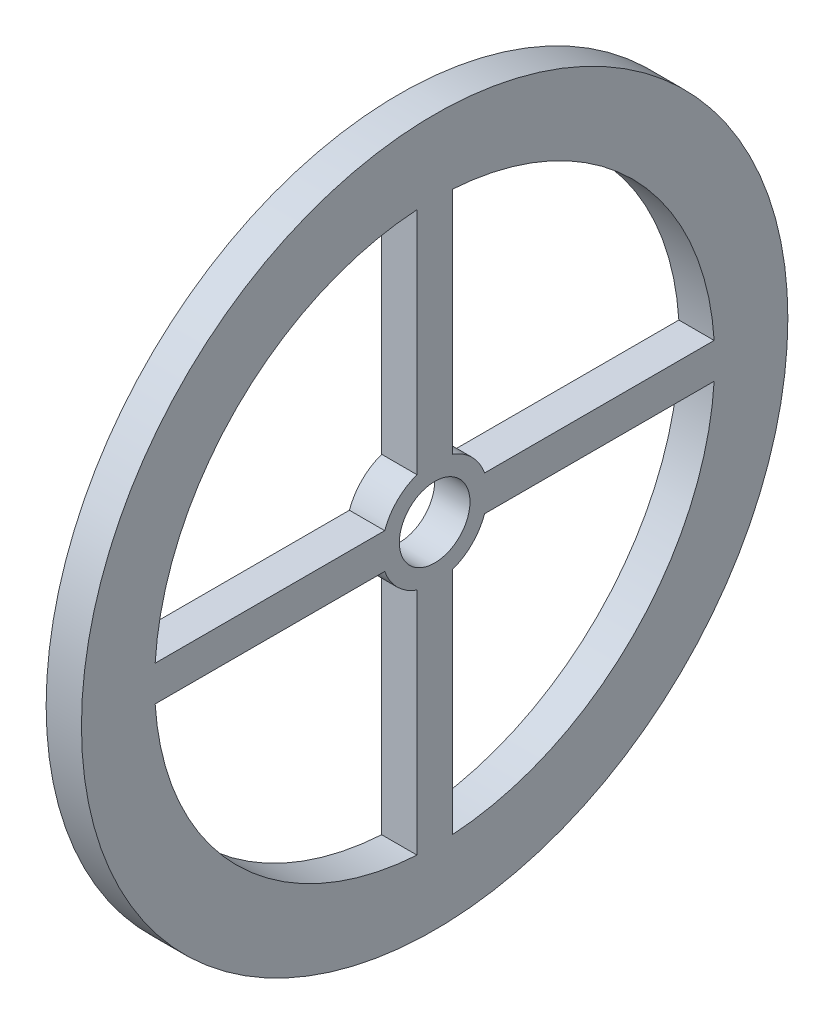
ISO-10303-21;
HEADER;
FILE_DESCRIPTION(('STEP AP214'),'2;1');
FILE_NAME('part.step','',(''),(''),'','','');
FILE_SCHEMA(('AUTOMOTIVE_DESIGN { 1 0 10303 214 1 1 1 1 }'));
ENDSEC;
DATA;
#1=APPLICATION_CONTEXT('core data for automotive mechanical design processes');
#2=APPLICATION_PROTOCOL_DEFINITION('international standard','automotive_design',2000,#1);
#3=PRODUCT_CONTEXT('',#1,'mechanical');
#4=PRODUCT('Part','Part','',(#3));
#5=PRODUCT_RELATED_PRODUCT_CATEGORY('part','',(#4));
#6=PRODUCT_DEFINITION_FORMATION('','',#4);
#7=PRODUCT_DEFINITION_CONTEXT('part definition',#1,'design');
#8=PRODUCT_DEFINITION('design','',#6,#7);
#9=PRODUCT_DEFINITION_SHAPE('','',#8);
#10=(LENGTH_UNIT() NAMED_UNIT(*) SI_UNIT(.MILLI.,.METRE.));
#11=(NAMED_UNIT(*) PLANE_ANGLE_UNIT() SI_UNIT($,.RADIAN.));
#12=(NAMED_UNIT(*) SI_UNIT($,.STERADIAN.) SOLID_ANGLE_UNIT());
#13=UNCERTAINTY_MEASURE_WITH_UNIT(LENGTH_MEASURE(1.E-05),#10,'distance_accuracy_value','');
#14=(GEOMETRIC_REPRESENTATION_CONTEXT(3) GLOBAL_UNCERTAINTY_ASSIGNED_CONTEXT((#13)) GLOBAL_UNIT_ASSIGNED_CONTEXT((#10,
#11,#12)) REPRESENTATION_CONTEXT('',''));
#15=CARTESIAN_POINT('',(0.,0.,0.));
#16=DIRECTION('',(0.,0.,1.));
#17=DIRECTION('',(1.,0.,0.));
#18=AXIS2_PLACEMENT_3D('',#15,#16,#17);
#19=CARTESIAN_POINT('',(10.,0.,0.));
#20=DIRECTION('',(-1.,0.,0.));
#21=DIRECTION('',(0.,0.,1.));
#22=AXIS2_PLACEMENT_3D('',#19,#20,#21);
#23=CYLINDRICAL_SURFACE('',#22,79.286499617892);
#24=CARTESIAN_POINT('',(0.,0.,0.));
#25=DIRECTION('',(1.,0.,0.));
#26=DIRECTION('',(0.,0.,-1.));
#27=AXIS2_PLACEMENT_3D('',#24,#25,#26);
#28=CIRCLE('',#27,79.286499617892);
#29=CARTESIAN_POINT('',(0.,5.,-79.1286864648845));
#30=VERTEX_POINT('',#29);
#31=CARTESIAN_POINT('',(0.,79.1286864648845,-4.99999999999999));
#32=VERTEX_POINT('',#31);
#33=EDGE_CURVE('E212',#30,#32,#28,.T.);
#34=ORIENTED_EDGE('',*,*,#33,.F.);
#35=DIRECTION('',(-1.,0.,0.));
#36=VECTOR('',#35,1.);
#37=CARTESIAN_POINT('',(10.,5.,-79.1286864648845));
#38=LINE('',#37,#36);
#39=CARTESIAN_POINT('',(10.,5.,-79.1286864648845));
#40=VERTEX_POINT('',#39);
#41=EDGE_CURVE('E11',#40,#30,#38,.T.);
#42=ORIENTED_EDGE('',*,*,#41,.F.);
#43=CARTESIAN_POINT('',(10.,0.,0.));
#44=DIRECTION('',(1.,0.,0.));
#45=DIRECTION('',(0.,0.,-1.));
#46=AXIS2_PLACEMENT_3D('',#43,#44,#45);
#47=CIRCLE('',#46,79.286499617892);
#48=CARTESIAN_POINT('',(10.,79.1286864648845,-4.99999999999999));
#49=VERTEX_POINT('',#48);
#50=EDGE_CURVE('E181',#40,#49,#47,.T.);
#51=ORIENTED_EDGE('',*,*,#50,.T.);
#52=DIRECTION('',(-1.,0.,0.));
#53=VECTOR('',#52,1.);
#54=CARTESIAN_POINT('',(10.,79.1286864648845,-4.99999999999999));
#55=LINE('',#54,#53);
#56=EDGE_CURVE('E59',#49,#32,#55,.T.);
#57=ORIENTED_EDGE('',*,*,#56,.T.);
#58=EDGE_LOOP('',(#34,#42,#51,#57));
#59=FACE_BOUND('',#58,.T.);
#60=ADVANCED_FACE('F40',(#59),#23,.F.);
#61=CARTESIAN_POINT('',(10.,5.,0.));
#62=DIRECTION('',(0.,1.,0.));
#63=DIRECTION('',(0.,0.,1.));
#64=AXIS2_PLACEMENT_3D('',#61,#62,#63);
#65=PLANE('',#64);
#66=DIRECTION('',(0.,0.,-1.));
#67=VECTOR('',#66,1.);
#68=CARTESIAN_POINT('',(0.,5.,0.));
#69=LINE('',#68,#67);
#70=CARTESIAN_POINT('',(0.,5.,-14.142135623731));
#71=VERTEX_POINT('',#70);
#72=EDGE_CURVE('E166',#71,#30,#69,.T.);
#73=ORIENTED_EDGE('',*,*,#72,.F.);
#74=DIRECTION('',(-1.,0.,0.));
#75=VECTOR('',#74,1.);
#76=CARTESIAN_POINT('',(10.,5.,-14.142135623731));
#77=LINE('',#76,#75);
#78=CARTESIAN_POINT('',(10.,5.,-14.142135623731));
#79=VERTEX_POINT('',#78);
#80=EDGE_CURVE('E50',#79,#71,#77,.T.);
#81=ORIENTED_EDGE('',*,*,#80,.F.);
#82=DIRECTION('',(0.,0.,-1.));
#83=VECTOR('',#82,1.);
#84=CARTESIAN_POINT('',(10.,5.,0.));
#85=LINE('',#84,#83);
#86=EDGE_CURVE('E164',#79,#40,#85,.T.);
#87=ORIENTED_EDGE('',*,*,#86,.T.);
#88=ORIENTED_EDGE('',*,*,#41,.T.);
#89=EDGE_LOOP('',(#73,#81,#87,#88));
#90=FACE_BOUND('',#89,.T.);
#91=ADVANCED_FACE('F162',(#90),#65,.T.);
#92=CARTESIAN_POINT('',(10.,0.,0.));
#93=DIRECTION('',(-1.,0.,0.));
#94=DIRECTION('',(0.,0.,1.));
#95=AXIS2_PLACEMENT_3D('',#92,#93,#94);
#96=CYLINDRICAL_SURFACE('',#95,15.);
#97=CARTESIAN_POINT('',(0.,0.,0.));
#98=DIRECTION('',(1.,0.,0.));
#99=DIRECTION('',(0.,0.,-1.));
#100=AXIS2_PLACEMENT_3D('',#97,#98,#99);
#101=CIRCLE('',#100,15.);
#102=CARTESIAN_POINT('',(0.,14.1421356237309,-5.));
#103=VERTEX_POINT('',#102);
#104=EDGE_CURVE('E204',#71,#103,#101,.T.);
#105=ORIENTED_EDGE('',*,*,#104,.T.);
#106=DIRECTION('',(-1.,0.,0.));
#107=VECTOR('',#106,1.);
#108=CARTESIAN_POINT('',(10.,14.1421356237309,-5.));
#109=LINE('',#108,#107);
#110=CARTESIAN_POINT('',(10.,14.1421356237309,-5.));
#111=VERTEX_POINT('',#110);
#112=EDGE_CURVE('E109',#111,#103,#109,.T.);
#113=ORIENTED_EDGE('',*,*,#112,.F.);
#114=CARTESIAN_POINT('',(10.,0.,0.));
#115=DIRECTION('',(1.,0.,0.));
#116=DIRECTION('',(0.,0.,-1.));
#117=AXIS2_PLACEMENT_3D('',#114,#115,#116);
#118=CIRCLE('',#117,15.);
#119=EDGE_CURVE('E170',#79,#111,#118,.T.);
#120=ORIENTED_EDGE('',*,*,#119,.F.);
#121=ORIENTED_EDGE('',*,*,#80,.T.);
#122=EDGE_LOOP('',(#105,#113,#120,#121));
#123=FACE_BOUND('',#122,.T.);
#124=ADVANCED_FACE('F171',(#123),#96,.T.);
#125=CARTESIAN_POINT('',(10.,0.,5.));
#126=DIRECTION('',(0.,0.,-1.));
#127=DIRECTION('',(0.,1.,0.));
#128=AXIS2_PLACEMENT_3D('',#125,#126,#127);
#129=PLANE('',#128);
#130=DIRECTION('',(0.,-1.,0.));
#131=VECTOR('',#130,1.);
#132=CARTESIAN_POINT('',(0.,0.,5.));
#133=LINE('',#132,#131);
#134=CARTESIAN_POINT('',(0.,79.1286864648845,5.00000000000001));
#135=VERTEX_POINT('',#134);
#136=CARTESIAN_POINT('',(0.,14.1421356237309,5.));
#137=VERTEX_POINT('',#136);
#138=EDGE_CURVE('E219',#135,#137,#133,.T.);
#139=ORIENTED_EDGE('',*,*,#138,.T.);
#140=DIRECTION('',(-1.,0.,0.));
#141=VECTOR('',#140,1.);
#142=CARTESIAN_POINT('',(10.,14.1421356237309,5.));
#143=LINE('',#142,#141);
#144=CARTESIAN_POINT('',(10.,14.1421356237309,5.));
#145=VERTEX_POINT('',#144);
#146=EDGE_CURVE('E239',#145,#137,#143,.T.);
#147=ORIENTED_EDGE('',*,*,#146,.F.);
#148=DIRECTION('',(0.,-1.,0.));
#149=VECTOR('',#148,1.);
#150=CARTESIAN_POINT('',(10.,0.,5.));
#151=LINE('',#150,#149);
#152=CARTESIAN_POINT('',(10.,79.1286864648845,5.00000000000001));
#153=VERTEX_POINT('',#152);
#154=EDGE_CURVE('E384',#153,#145,#151,.T.);
#155=ORIENTED_EDGE('',*,*,#154,.F.);
#156=DIRECTION('',(-1.,0.,0.));
#157=VECTOR('',#156,1.);
#158=CARTESIAN_POINT('',(10.,79.1286864648845,5.00000000000001));
#159=LINE('',#158,#157);
#160=EDGE_CURVE('E241',#153,#135,#159,.T.);
#161=ORIENTED_EDGE('',*,*,#160,.T.);
#162=EDGE_LOOP('',(#139,#147,#155,#161));
#163=FACE_BOUND('',#162,.T.);
#164=ADVANCED_FACE('F357',(#163),#129,.F.);
#165=CARTESIAN_POINT('',(0.,5.,14.142135623731));
#166=VERTEX_POINT('',#165);
#167=EDGE_CURVE('E222',#137,#166,#101,.T.);
#168=ORIENTED_EDGE('',*,*,#167,.T.);
#169=DIRECTION('',(-1.,0.,0.));
#170=VECTOR('',#169,1.);
#171=CARTESIAN_POINT('',(10.,5.,14.142135623731));
#172=LINE('',#171,#170);
#173=CARTESIAN_POINT('',(10.,5.,14.142135623731));
#174=VERTEX_POINT('',#173);
#175=EDGE_CURVE('E246',#174,#166,#172,.T.);
#176=ORIENTED_EDGE('',*,*,#175,.F.);
#177=EDGE_CURVE('E176',#145,#174,#118,.T.);
#178=ORIENTED_EDGE('',*,*,#177,.F.);
#179=ORIENTED_EDGE('',*,*,#146,.T.);
#180=EDGE_LOOP('',(#168,#176,#178,#179));
#181=FACE_BOUND('',#180,.T.);
#182=ADVANCED_FACE('F358',(#181),#96,.T.);
#183=CARTESIAN_POINT('',(10.,5.,0.));
#184=DIRECTION('',(0.,1.,0.));
#185=DIRECTION('',(0.,0.,1.));
#186=AXIS2_PLACEMENT_3D('',#183,#184,#185);
#187=PLANE('',#186);
#188=DIRECTION('',(0.,0.,-1.));
#189=VECTOR('',#188,1.);
#190=CARTESIAN_POINT('',(0.,5.,0.));
#191=LINE('',#190,#189);
#192=CARTESIAN_POINT('',(0.,5.,79.1286864648845));
#193=VERTEX_POINT('',#192);
#194=EDGE_CURVE('E223',#193,#166,#191,.T.);
#195=ORIENTED_EDGE('',*,*,#194,.F.);
#196=DIRECTION('',(-1.,0.,0.));
#197=VECTOR('',#196,1.);
#198=CARTESIAN_POINT('',(10.,5.,79.1286864648845));
#199=LINE('',#198,#197);
#200=CARTESIAN_POINT('',(10.,5.,79.1286864648845));
#201=VERTEX_POINT('',#200);
#202=EDGE_CURVE('E243',#201,#193,#199,.T.);
#203=ORIENTED_EDGE('',*,*,#202,.F.);
#204=DIRECTION('',(0.,0.,-1.));
#205=VECTOR('',#204,1.);
#206=CARTESIAN_POINT('',(10.,5.,0.));
#207=LINE('',#206,#205);
#208=EDGE_CURVE('E188',#201,#174,#207,.T.);
#209=ORIENTED_EDGE('',*,*,#208,.T.);
#210=ORIENTED_EDGE('',*,*,#175,.T.);
#211=EDGE_LOOP('',(#195,#203,#209,#210));
#212=FACE_BOUND('',#211,.T.);
#213=ADVANCED_FACE('F365',(#212),#187,.T.);
#214=CARTESIAN_POINT('',(10.,-5.,0.));
#215=DIRECTION('',(0.,1.,0.));
#216=DIRECTION('',(0.,0.,1.));
#217=AXIS2_PLACEMENT_3D('',#214,#215,#216);
#218=PLANE('',#217);
#219=DIRECTION('',(0.,0.,-1.));
#220=VECTOR('',#219,1.);
#221=CARTESIAN_POINT('',(0.,-5.,0.));
#222=LINE('',#221,#220);
#223=CARTESIAN_POINT('',(0.,-5.,79.1286864648845));
#224=VERTEX_POINT('',#223);
#225=CARTESIAN_POINT('',(0.,-5.,14.142135623731));
#226=VERTEX_POINT('',#225);
#227=EDGE_CURVE('E211',#224,#226,#222,.T.);
#228=ORIENTED_EDGE('',*,*,#227,.T.);
#229=DIRECTION('',(-1.,0.,0.));
#230=VECTOR('',#229,1.);
#231=CARTESIAN_POINT('',(10.,-5.,14.142135623731));
#232=LINE('',#231,#230);
#233=CARTESIAN_POINT('',(10.,-5.,14.142135623731));
#234=VERTEX_POINT('',#233);
#235=EDGE_CURVE('E244',#234,#226,#232,.T.);
#236=ORIENTED_EDGE('',*,*,#235,.F.);
#237=DIRECTION('',(0.,0.,-1.));
#238=VECTOR('',#237,1.);
#239=CARTESIAN_POINT('',(10.,-5.,0.));
#240=LINE('',#239,#238);
#241=CARTESIAN_POINT('',(10.,-5.,79.1286864648845));
#242=VERTEX_POINT('',#241);
#243=EDGE_CURVE('E380',#242,#234,#240,.T.);
#244=ORIENTED_EDGE('',*,*,#243,.F.);
#245=DIRECTION('',(-1.,0.,0.));
#246=VECTOR('',#245,1.);
#247=CARTESIAN_POINT('',(10.,-5.,79.1286864648845));
#248=LINE('',#247,#246);
#249=EDGE_CURVE('E250',#242,#224,#248,.T.);
#250=ORIENTED_EDGE('',*,*,#249,.T.);
#251=EDGE_LOOP('',(#228,#236,#244,#250));
#252=FACE_BOUND('',#251,.T.);
#253=ADVANCED_FACE('F369',(#252),#218,.F.);
#254=CARTESIAN_POINT('',(0.,-14.1421356237309,5.));
#255=VERTEX_POINT('',#254);
#256=EDGE_CURVE('E205',#226,#255,#101,.T.);
#257=ORIENTED_EDGE('',*,*,#256,.T.);
#258=DIRECTION('',(-1.,0.,0.));
#259=VECTOR('',#258,1.);
#260=CARTESIAN_POINT('',(10.,-14.1421356237309,5.));
#261=LINE('',#260,#259);
#262=CARTESIAN_POINT('',(10.,-14.1421356237309,5.));
#263=VERTEX_POINT('',#262);
#264=EDGE_CURVE('E254',#263,#255,#261,.T.);
#265=ORIENTED_EDGE('',*,*,#264,.F.);
#266=EDGE_CURVE('E334',#234,#263,#118,.T.);
#267=ORIENTED_EDGE('',*,*,#266,.F.);
#268=ORIENTED_EDGE('',*,*,#235,.T.);
#269=EDGE_LOOP('',(#257,#265,#267,#268));
#270=FACE_BOUND('',#269,.T.);
#271=ADVANCED_FACE('F291',(#270),#96,.T.);
#272=CARTESIAN_POINT('',(10.,0.,5.));
#273=DIRECTION('',(0.,0.,-1.));
#274=DIRECTION('',(0.,1.,0.));
#275=AXIS2_PLACEMENT_3D('',#272,#273,#274);
#276=PLANE('',#275);
#277=DIRECTION('',(0.,-1.,0.));
#278=VECTOR('',#277,1.);
#279=CARTESIAN_POINT('',(0.,0.,5.));
#280=LINE('',#279,#278);
#281=CARTESIAN_POINT('',(0.,-79.1286864648845,5.00000000000001));
#282=VERTEX_POINT('',#281);
#283=EDGE_CURVE('E216',#255,#282,#280,.T.);
#284=ORIENTED_EDGE('',*,*,#283,.T.);
#285=DIRECTION('',(-1.,0.,0.));
#286=VECTOR('',#285,1.);
#287=CARTESIAN_POINT('',(10.,-79.1286864648845,5.00000000000001));
#288=LINE('',#287,#286);
#289=CARTESIAN_POINT('',(10.,-79.1286864648845,5.00000000000001));
#290=VERTEX_POINT('',#289);
#291=EDGE_CURVE('E252',#290,#282,#288,.T.);
#292=ORIENTED_EDGE('',*,*,#291,.F.);
#293=DIRECTION('',(0.,-1.,0.));
#294=VECTOR('',#293,1.);
#295=CARTESIAN_POINT('',(10.,0.,5.));
#296=LINE('',#295,#294);
#297=EDGE_CURVE('E332',#263,#290,#296,.T.);
#298=ORIENTED_EDGE('',*,*,#297,.F.);
#299=ORIENTED_EDGE('',*,*,#264,.T.);
#300=EDGE_LOOP('',(#284,#292,#298,#299));
#301=FACE_BOUND('',#300,.T.);
#302=ADVANCED_FACE('F330',(#301),#276,.F.);
#303=CARTESIAN_POINT('',(10.,0.,-5.));
#304=DIRECTION('',(0.,0.,-1.));
#305=DIRECTION('',(0.,1.,0.));
#306=AXIS2_PLACEMENT_3D('',#303,#304,#305);
#307=PLANE('',#306);
#308=DIRECTION('',(0.,-1.,0.));
#309=VECTOR('',#308,1.);
#310=CARTESIAN_POINT('',(0.,0.,-5.));
#311=LINE('',#310,#309);
#312=CARTESIAN_POINT('',(0.,-14.1421356237309,-5.));
#313=VERTEX_POINT('',#312);
#314=CARTESIAN_POINT('',(0.,-79.1286864648845,-5.00000000000001));
#315=VERTEX_POINT('',#314);
#316=EDGE_CURVE('E198',#313,#315,#311,.T.);
#317=ORIENTED_EDGE('',*,*,#316,.F.);
#318=DIRECTION('',(-1.,0.,0.));
#319=VECTOR('',#318,1.);
#320=CARTESIAN_POINT('',(10.,-14.1421356237309,-5.));
#321=LINE('',#320,#319);
#322=CARTESIAN_POINT('',(10.,-14.1421356237309,-5.));
#323=VERTEX_POINT('',#322);
#324=EDGE_CURVE('E44',#323,#313,#321,.T.);
#325=ORIENTED_EDGE('',*,*,#324,.F.);
#326=DIRECTION('',(0.,-1.,0.));
#327=VECTOR('',#326,1.);
#328=CARTESIAN_POINT('',(10.,0.,-5.));
#329=LINE('',#328,#327);
#330=CARTESIAN_POINT('',(10.,-79.1286864648845,-5.00000000000001));
#331=VERTEX_POINT('',#330);
#332=EDGE_CURVE('E237',#323,#331,#329,.T.);
#333=ORIENTED_EDGE('',*,*,#332,.T.);
#334=DIRECTION('',(-1.,0.,0.));
#335=VECTOR('',#334,1.);
#336=CARTESIAN_POINT('',(10.,-79.1286864648845,-5.00000000000001));
#337=LINE('',#336,#335);
#338=EDGE_CURVE('E197',#331,#315,#337,.T.);
#339=ORIENTED_EDGE('',*,*,#338,.T.);
#340=EDGE_LOOP('',(#317,#325,#333,#339));
#341=FACE_BOUND('',#340,.T.);
#342=ADVANCED_FACE('F42',(#341),#307,.T.);
#343=CARTESIAN_POINT('',(0.,-5.,-14.142135623731));
#344=VERTEX_POINT('',#343);
#345=EDGE_CURVE('E201',#313,#344,#101,.T.);
#346=ORIENTED_EDGE('',*,*,#345,.T.);
#347=DIRECTION('',(-1.,0.,0.));
#348=VECTOR('',#347,1.);
#349=CARTESIAN_POINT('',(10.,-5.,-14.142135623731));
#350=LINE('',#349,#348);
#351=CARTESIAN_POINT('',(10.,-5.,-14.142135623731));
#352=VERTEX_POINT('',#351);
#353=EDGE_CURVE('E261',#352,#344,#350,.T.);
#354=ORIENTED_EDGE('',*,*,#353,.F.);
#355=EDGE_CURVE('E177',#323,#352,#118,.T.);
#356=ORIENTED_EDGE('',*,*,#355,.F.);
#357=ORIENTED_EDGE('',*,*,#324,.T.);
#358=EDGE_LOOP('',(#346,#354,#356,#357));
#359=FACE_BOUND('',#358,.T.);
#360=ADVANCED_FACE('F269',(#359),#96,.T.);
#361=CARTESIAN_POINT('',(10.,-5.,0.));
#362=DIRECTION('',(0.,1.,0.));
#363=DIRECTION('',(0.,0.,1.));
#364=AXIS2_PLACEMENT_3D('',#361,#362,#363);
#365=PLANE('',#364);
#366=DIRECTION('',(0.,0.,-1.));
#367=VECTOR('',#366,1.);
#368=CARTESIAN_POINT('',(0.,-5.,0.));
#369=LINE('',#368,#367);
#370=CARTESIAN_POINT('',(0.,-5.,-79.1286864648845));
#371=VERTEX_POINT('',#370);
#372=EDGE_CURVE('E203',#344,#371,#369,.T.);
#373=ORIENTED_EDGE('',*,*,#372,.T.);
#374=DIRECTION('',(-1.,0.,0.));
#375=VECTOR('',#374,1.);
#376=CARTESIAN_POINT('',(10.,-5.,-79.1286864648845));
#377=LINE('',#376,#375);
#378=CARTESIAN_POINT('',(10.,-5.,-79.1286864648845));
#379=VERTEX_POINT('',#378);
#380=EDGE_CURVE('E260',#379,#371,#377,.T.);
#381=ORIENTED_EDGE('',*,*,#380,.F.);
#382=DIRECTION('',(0.,0.,-1.));
#383=VECTOR('',#382,1.);
#384=CARTESIAN_POINT('',(10.,-5.,0.));
#385=LINE('',#384,#383);
#386=EDGE_CURVE('E388',#352,#379,#385,.T.);
#387=ORIENTED_EDGE('',*,*,#386,.F.);
#388=ORIENTED_EDGE('',*,*,#353,.T.);
#389=EDGE_LOOP('',(#373,#381,#387,#388));
#390=FACE_BOUND('',#389,.T.);
#391=ADVANCED_FACE('F280',(#390),#365,.F.);
#392=CARTESIAN_POINT('',(10.,0.,0.));
#393=DIRECTION('',(-1.,0.,0.));
#394=DIRECTION('',(0.,0.,1.));
#395=AXIS2_PLACEMENT_3D('',#392,#393,#394);
#396=CYLINDRICAL_SURFACE('',#395,100.);
#397=CARTESIAN_POINT('',(10.,0.,0.));
#398=DIRECTION('',(1.,0.,0.));
#399=DIRECTION('',(0.,0.,-1.));
#400=AXIS2_PLACEMENT_3D('',#397,#398,#399);
#401=CIRCLE('',#400,100.);
#402=CARTESIAN_POINT('',(10.,0.,-100.));
#403=VERTEX_POINT('',#402);
#404=EDGE_CURVE('E191',#403,#403,#401,.T.);
#405=ORIENTED_EDGE('',*,*,#404,.F.);
#406=EDGE_LOOP('',(#405));
#407=FACE_BOUND('',#406,.T.);
#408=CARTESIAN_POINT('',(0.,0.,0.));
#409=DIRECTION('',(1.,0.,0.));
#410=DIRECTION('',(0.,0.,-1.));
#411=AXIS2_PLACEMENT_3D('',#408,#409,#410);
#412=CIRCLE('',#411,100.);
#413=CARTESIAN_POINT('',(0.,0.,-100.));
#414=VERTEX_POINT('',#413);
#415=EDGE_CURVE('E231',#414,#414,#412,.T.);
#416=ORIENTED_EDGE('',*,*,#415,.T.);
#417=EDGE_LOOP('',(#416));
#418=FACE_BOUND('',#417,.T.);
#419=ADVANCED_FACE('F282',(#407,#418),#396,.T.);
#420=CARTESIAN_POINT('',(10.,0.,-5.));
#421=DIRECTION('',(0.,0.,-1.));
#422=DIRECTION('',(0.,1.,0.));
#423=AXIS2_PLACEMENT_3D('',#420,#421,#422);
#424=PLANE('',#423);
#425=DIRECTION('',(0.,-1.,0.));
#426=VECTOR('',#425,1.);
#427=CARTESIAN_POINT('',(0.,0.,-5.));
#428=LINE('',#427,#426);
#429=EDGE_CURVE('E228',#32,#103,#428,.T.);
#430=ORIENTED_EDGE('',*,*,#429,.F.);
#431=ORIENTED_EDGE('',*,*,#56,.F.);
#432=DIRECTION('',(0.,-1.,0.));
#433=VECTOR('',#432,1.);
#434=CARTESIAN_POINT('',(10.,0.,-5.));
#435=LINE('',#434,#433);
#436=EDGE_CURVE('E174',#49,#111,#435,.T.);
#437=ORIENTED_EDGE('',*,*,#436,.T.);
#438=ORIENTED_EDGE('',*,*,#112,.T.);
#439=EDGE_LOOP('',(#430,#431,#437,#438));
#440=FACE_BOUND('',#439,.T.);
#441=ADVANCED_FACE('F287',(#440),#424,.T.);
#442=EDGE_CURVE('E226',#135,#193,#28,.T.);
#443=ORIENTED_EDGE('',*,*,#442,.F.);
#444=ORIENTED_EDGE('',*,*,#160,.F.);
#445=EDGE_CURVE('E183',#153,#201,#47,.T.);
#446=ORIENTED_EDGE('',*,*,#445,.T.);
#447=ORIENTED_EDGE('',*,*,#202,.T.);
#448=EDGE_LOOP('',(#443,#444,#446,#447));
#449=FACE_BOUND('',#448,.T.);
#450=ADVANCED_FACE('F295',(#449),#23,.F.);
#451=EDGE_CURVE('E213',#224,#282,#28,.T.);
#452=ORIENTED_EDGE('',*,*,#451,.F.);
#453=ORIENTED_EDGE('',*,*,#249,.F.);
#454=EDGE_CURVE('E327',#242,#290,#47,.T.);
#455=ORIENTED_EDGE('',*,*,#454,.T.);
#456=ORIENTED_EDGE('',*,*,#291,.T.);
#457=EDGE_LOOP('',(#452,#453,#455,#456));
#458=FACE_BOUND('',#457,.T.);
#459=ADVANCED_FACE('F303',(#458),#23,.F.);
#460=EDGE_CURVE('E208',#315,#371,#28,.T.);
#461=ORIENTED_EDGE('',*,*,#460,.F.);
#462=ORIENTED_EDGE('',*,*,#338,.F.);
#463=EDGE_CURVE('E185',#331,#379,#47,.T.);
#464=ORIENTED_EDGE('',*,*,#463,.T.);
#465=ORIENTED_EDGE('',*,*,#380,.T.);
#466=EDGE_LOOP('',(#461,#462,#464,#465));
#467=FACE_BOUND('',#466,.T.);
#468=ADVANCED_FACE('F278',(#467),#23,.F.);
#469=CARTESIAN_POINT('',(10.,0.,0.));
#470=DIRECTION('',(-1.,0.,0.));
#471=DIRECTION('',(0.,0.,1.));
#472=AXIS2_PLACEMENT_3D('',#469,#470,#471);
#473=CYLINDRICAL_SURFACE('',#472,10.);
#474=CARTESIAN_POINT('',(10.,0.,0.));
#475=DIRECTION('',(1.,0.,0.));
#476=DIRECTION('',(0.,0.,-1.));
#477=AXIS2_PLACEMENT_3D('',#474,#475,#476);
#478=CIRCLE('',#477,10.);
#479=CARTESIAN_POINT('',(10.,0.,-10.));
#480=VERTEX_POINT('',#479);
#481=EDGE_CURVE('E194',#480,#480,#478,.T.);
#482=ORIENTED_EDGE('',*,*,#481,.T.);
#483=EDGE_LOOP('',(#482));
#484=FACE_BOUND('',#483,.T.);
#485=CARTESIAN_POINT('',(0.,0.,0.));
#486=DIRECTION('',(1.,0.,0.));
#487=DIRECTION('',(0.,0.,-1.));
#488=AXIS2_PLACEMENT_3D('',#485,#486,#487);
#489=CIRCLE('',#488,10.);
#490=CARTESIAN_POINT('',(0.,0.,-10.));
#491=VERTEX_POINT('',#490);
#492=EDGE_CURVE('E234',#491,#491,#489,.T.);
#493=ORIENTED_EDGE('',*,*,#492,.F.);
#494=EDGE_LOOP('',(#493));
#495=FACE_BOUND('',#494,.T.);
#496=ADVANCED_FACE('F302',(#484,#495),#473,.F.);
#497=CARTESIAN_POINT('',(10.,0.,0.));
#498=DIRECTION('',(1.,0.,0.));
#499=DIRECTION('',(0.,0.,-1.));
#500=AXIS2_PLACEMENT_3D('',#497,#498,#499);
#501=PLANE('',#500);
#502=ORIENTED_EDGE('',*,*,#332,.F.);
#503=ORIENTED_EDGE('',*,*,#355,.T.);
#504=ORIENTED_EDGE('',*,*,#386,.T.);
#505=ORIENTED_EDGE('',*,*,#463,.F.);
#506=EDGE_LOOP('',(#502,#503,#504,#505));
#507=FACE_BOUND('',#506,.T.);
#508=ORIENTED_EDGE('',*,*,#243,.T.);
#509=ORIENTED_EDGE('',*,*,#266,.T.);
#510=ORIENTED_EDGE('',*,*,#297,.T.);
#511=ORIENTED_EDGE('',*,*,#454,.F.);
#512=EDGE_LOOP('',(#508,#509,#510,#511));
#513=FACE_BOUND('',#512,.T.);
#514=ORIENTED_EDGE('',*,*,#154,.T.);
#515=ORIENTED_EDGE('',*,*,#177,.T.);
#516=ORIENTED_EDGE('',*,*,#208,.F.);
#517=ORIENTED_EDGE('',*,*,#445,.F.);
#518=EDGE_LOOP('',(#514,#515,#516,#517));
#519=FACE_BOUND('',#518,.T.);
#520=ORIENTED_EDGE('',*,*,#50,.F.);
#521=ORIENTED_EDGE('',*,*,#86,.F.);
#522=ORIENTED_EDGE('',*,*,#119,.T.);
#523=ORIENTED_EDGE('',*,*,#436,.F.);
#524=EDGE_LOOP('',(#520,#521,#522,#523));
#525=FACE_BOUND('',#524,.T.);
#526=ORIENTED_EDGE('',*,*,#404,.T.);
#527=EDGE_LOOP('',(#526));
#528=FACE_BOUND('',#527,.T.);
#529=ORIENTED_EDGE('',*,*,#481,.F.);
#530=EDGE_LOOP('',(#529));
#531=FACE_BOUND('',#530,.T.);
#532=ADVANCED_FACE('F179',(#507,#513,#519,#525,#528,#531),#501,.T.);
#533=CARTESIAN_POINT('',(0.,0.,0.));
#534=DIRECTION('',(1.,0.,0.));
#535=DIRECTION('',(0.,0.,-1.));
#536=AXIS2_PLACEMENT_3D('',#533,#534,#535);
#537=PLANE('',#536);
#538=ORIENTED_EDGE('',*,*,#316,.T.);
#539=ORIENTED_EDGE('',*,*,#460,.T.);
#540=ORIENTED_EDGE('',*,*,#372,.F.);
#541=ORIENTED_EDGE('',*,*,#345,.F.);
#542=EDGE_LOOP('',(#538,#539,#540,#541));
#543=FACE_BOUND('',#542,.T.);
#544=ORIENTED_EDGE('',*,*,#227,.F.);
#545=ORIENTED_EDGE('',*,*,#451,.T.);
#546=ORIENTED_EDGE('',*,*,#283,.F.);
#547=ORIENTED_EDGE('',*,*,#256,.F.);
#548=EDGE_LOOP('',(#544,#545,#546,#547));
#549=FACE_BOUND('',#548,.T.);
#550=ORIENTED_EDGE('',*,*,#138,.F.);
#551=ORIENTED_EDGE('',*,*,#442,.T.);
#552=ORIENTED_EDGE('',*,*,#194,.T.);
#553=ORIENTED_EDGE('',*,*,#167,.F.);
#554=EDGE_LOOP('',(#550,#551,#552,#553));
#555=FACE_BOUND('',#554,.T.);
#556=ORIENTED_EDGE('',*,*,#33,.T.);
#557=ORIENTED_EDGE('',*,*,#429,.T.);
#558=ORIENTED_EDGE('',*,*,#104,.F.);
#559=ORIENTED_EDGE('',*,*,#72,.T.);
#560=EDGE_LOOP('',(#556,#557,#558,#559));
#561=FACE_BOUND('',#560,.T.);
#562=ORIENTED_EDGE('',*,*,#415,.F.);
#563=EDGE_LOOP('',(#562));
#564=FACE_BOUND('',#563,.T.);
#565=ORIENTED_EDGE('',*,*,#492,.T.);
#566=EDGE_LOOP('',(#565));
#567=FACE_BOUND('',#566,.T.);
#568=ADVANCED_FACE('F272',(#543,#549,#555,#561,#564,#567),#537,.F.);
#569=CLOSED_SHELL('',(#60,#91,#124,#164,#182,#213,#253,#271,#302,#342,#360,#391,#419,#441,#450,
#459,#468,#496,#532,#568));
#570=MANIFOLD_SOLID_BREP('B2',#569);
#571=ADVANCED_BREP_SHAPE_REPRESENTATION('',(#18,#570),#14);
#572=SHAPE_DEFINITION_REPRESENTATION(#9,#571);
ENDSEC;
END-ISO-10303-21;
